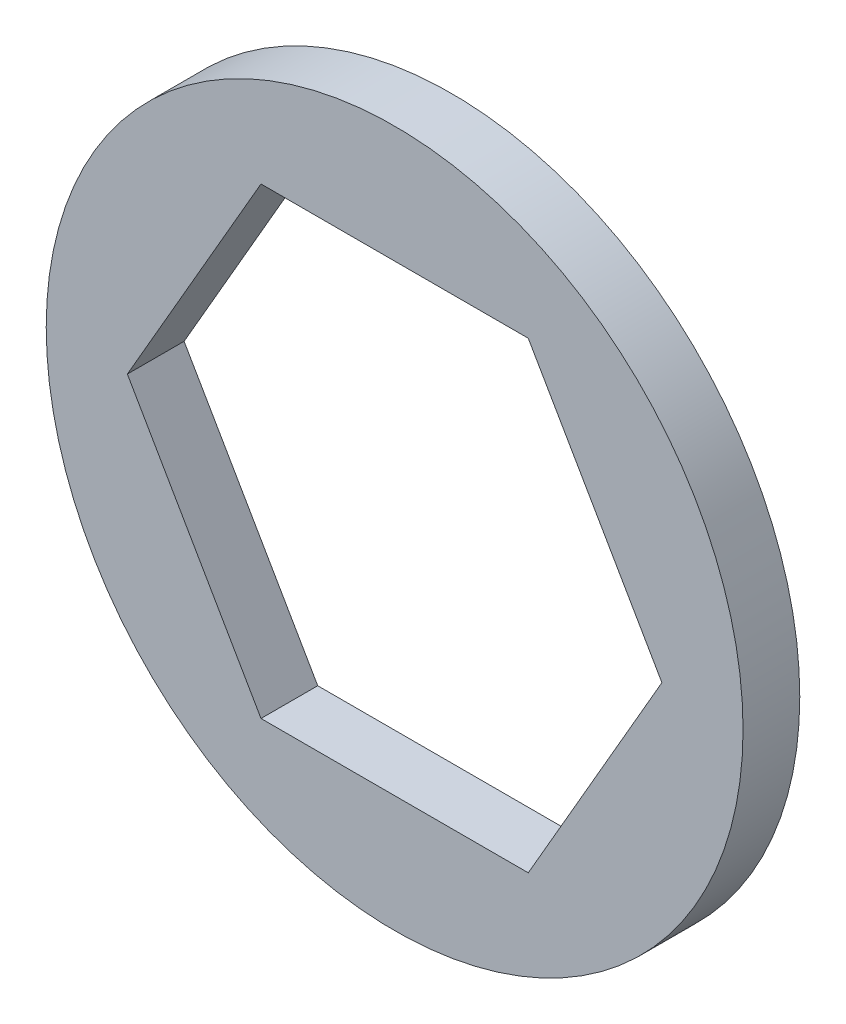
ISO-10303-21;
HEADER;
FILE_DESCRIPTION(('STEP AP214'),'2;1');
FILE_NAME('part.step','',(''),(''),'','','');
FILE_SCHEMA(('AUTOMOTIVE_DESIGN { 1 0 10303 214 1 1 1 1 }'));
ENDSEC;
DATA;
#1=APPLICATION_CONTEXT('core data for automotive mechanical design processes');
#2=APPLICATION_PROTOCOL_DEFINITION('international standard','automotive_design',2000,#1);
#3=PRODUCT_CONTEXT('',#1,'mechanical');
#4=PRODUCT('Part','Part','',(#3));
#5=PRODUCT_RELATED_PRODUCT_CATEGORY('part','',(#4));
#6=PRODUCT_DEFINITION_FORMATION('','',#4);
#7=PRODUCT_DEFINITION_CONTEXT('part definition',#1,'design');
#8=PRODUCT_DEFINITION('design','',#6,#7);
#9=PRODUCT_DEFINITION_SHAPE('','',#8);
#10=(LENGTH_UNIT() NAMED_UNIT(*) SI_UNIT(.MILLI.,.METRE.));
#11=(NAMED_UNIT(*) PLANE_ANGLE_UNIT() SI_UNIT($,.RADIAN.));
#12=(NAMED_UNIT(*) SI_UNIT($,.STERADIAN.) SOLID_ANGLE_UNIT());
#13=UNCERTAINTY_MEASURE_WITH_UNIT(LENGTH_MEASURE(1.E-05),#10,'distance_accuracy_value','');
#14=(GEOMETRIC_REPRESENTATION_CONTEXT(3) GLOBAL_UNCERTAINTY_ASSIGNED_CONTEXT((#13)) GLOBAL_UNIT_ASSIGNED_CONTEXT((#10,
#11,#12)) REPRESENTATION_CONTEXT('',''));
#15=CARTESIAN_POINT('',(0.,0.,0.));
#16=DIRECTION('',(0.,0.,1.));
#17=DIRECTION('',(1.,0.,0.));
#18=AXIS2_PLACEMENT_3D('',#15,#16,#17);
#19=CARTESIAN_POINT('',(0.,0.,0.79375));
#20=DIRECTION('',(0.,0.,1.));
#21=DIRECTION('',(1.,0.,0.));
#22=AXIS2_PLACEMENT_3D('',#19,#20,#21);
#23=PLANE('',#22);
#24=DIRECTION('',(1.,0.,0.));
#25=VECTOR('',#24,1.);
#26=CARTESIAN_POINT('',(3.7394976935412,6.477,0.79375));
#27=LINE('',#26,#25);
#28=CARTESIAN_POINT('',(3.7394976935412,6.477,0.79375));
#29=VERTEX_POINT('',#28);
#30=CARTESIAN_POINT('',(-3.73949769354121,6.477,0.79375));
#31=VERTEX_POINT('',#30);
#32=EDGE_CURVE('E67',#29,#31,#27,.F.);
#33=ORIENTED_EDGE('',*,*,#32,.F.);
#34=DIRECTION('',(0.5,-0.866025403784439,0.));
#35=VECTOR('',#34,1.);
#36=CARTESIAN_POINT('',(7.47899538708241,0.,0.79375));
#37=LINE('',#36,#35);
#38=CARTESIAN_POINT('',(7.47899538708242,0.,0.79375));
#39=VERTEX_POINT('',#38);
#40=EDGE_CURVE('E115',#39,#29,#37,.F.);
#41=ORIENTED_EDGE('',*,*,#40,.F.);
#42=DIRECTION('',(-0.5,-0.866025403784439,0.));
#43=VECTOR('',#42,1.);
#44=CARTESIAN_POINT('',(3.73949769354121,-6.477,0.79375));
#45=LINE('',#44,#43);
#46=CARTESIAN_POINT('',(3.73949769354121,-6.477,0.79375));
#47=VERTEX_POINT('',#46);
#48=EDGE_CURVE('E111',#47,#39,#45,.F.);
#49=ORIENTED_EDGE('',*,*,#48,.F.);
#50=DIRECTION('',(1.,0.,0.));
#51=VECTOR('',#50,1.);
#52=CARTESIAN_POINT('',(-3.73949769354121,-6.477,0.79375));
#53=LINE('',#52,#51);
#54=CARTESIAN_POINT('',(-3.73949769354121,-6.477,0.79375));
#55=VERTEX_POINT('',#54);
#56=EDGE_CURVE('E86',#55,#47,#53,.T.);
#57=ORIENTED_EDGE('',*,*,#56,.F.);
#58=DIRECTION('',(-0.5,0.866025403784439,0.));
#59=VECTOR('',#58,1.);
#60=CARTESIAN_POINT('',(-7.47899538708241,0.,0.79375));
#61=LINE('',#60,#59);
#62=CARTESIAN_POINT('',(-7.47899538708241,0.,0.79375));
#63=VERTEX_POINT('',#62);
#64=EDGE_CURVE('E81',#63,#55,#61,.F.);
#65=ORIENTED_EDGE('',*,*,#64,.F.);
#66=DIRECTION('',(0.5,0.866025403784439,0.));
#67=VECTOR('',#66,1.);
#68=CARTESIAN_POINT('',(-3.73949769354121,6.477,0.79375));
#69=LINE('',#68,#67);
#70=EDGE_CURVE('E72',#31,#63,#69,.F.);
#71=ORIENTED_EDGE('',*,*,#70,.F.);
#72=EDGE_LOOP('',(#33,#41,#49,#57,#65,#71));
#73=FACE_BOUND('',#72,.T.);
#74=CARTESIAN_POINT('',(0.,0.,0.79375));
#75=DIRECTION('',(0.,0.,-1.));
#76=DIRECTION('',(-1.,0.,0.));
#77=AXIS2_PLACEMENT_3D('',#74,#75,#76);
#78=CIRCLE('',#77,9.75);
#79=CARTESIAN_POINT('',(-9.75,0.,0.79375));
#80=VERTEX_POINT('',#79);
#81=EDGE_CURVE('E21',#80,#80,#78,.T.);
#82=ORIENTED_EDGE('',*,*,#81,.F.);
#83=EDGE_LOOP('',(#82));
#84=FACE_BOUND('',#83,.T.);
#85=ADVANCED_FACE('F18',(#73,#84),#23,.T.);
#86=CARTESIAN_POINT('',(0.,0.,0.79375));
#87=DIRECTION('',(0.,0.,-1.));
#88=DIRECTION('',(-1.,0.,0.));
#89=AXIS2_PLACEMENT_3D('',#86,#87,#88);
#90=CYLINDRICAL_SURFACE('',#89,9.75);
#91=ORIENTED_EDGE('',*,*,#81,.T.);
#92=EDGE_LOOP('',(#91));
#93=FACE_BOUND('',#92,.T.);
#94=CARTESIAN_POINT('',(0.,0.,-0.79375));
#95=DIRECTION('',(0.,0.,-1.));
#96=DIRECTION('',(-1.,0.,0.));
#97=AXIS2_PLACEMENT_3D('',#94,#95,#96);
#98=CIRCLE('',#97,9.75);
#99=CARTESIAN_POINT('',(-9.75,0.,-0.79375));
#100=VERTEX_POINT('',#99);
#101=EDGE_CURVE('E97',#100,#100,#98,.F.);
#102=ORIENTED_EDGE('',*,*,#101,.T.);
#103=EDGE_LOOP('',(#102));
#104=FACE_BOUND('',#103,.T.);
#105=ADVANCED_FACE('F182',(#93,#104),#90,.T.);
#106=CARTESIAN_POINT('',(-7.47899538708241,0.,0.79375));
#107=DIRECTION('',(0.866025403784439,0.5,0.));
#108=DIRECTION('',(-0.5,0.866025403784439,0.));
#109=AXIS2_PLACEMENT_3D('',#106,#107,#108);
#110=PLANE('',#109);
#111=ORIENTED_EDGE('',*,*,#64,.T.);
#112=DIRECTION('',(0.,0.,1.));
#113=VECTOR('',#112,1.);
#114=CARTESIAN_POINT('',(-3.73949769354121,-6.477,0.79375));
#115=LINE('',#114,#113);
#116=CARTESIAN_POINT('',(-3.73949769354121,-6.477,-0.79375));
#117=VERTEX_POINT('',#116);
#118=EDGE_CURVE('E104',#117,#55,#115,.T.);
#119=ORIENTED_EDGE('',*,*,#118,.F.);
#120=DIRECTION('',(-0.5,0.866025403784439,0.));
#121=VECTOR('',#120,1.);
#122=CARTESIAN_POINT('',(-3.73949769354121,-6.477,-0.79375));
#123=LINE('',#122,#121);
#124=CARTESIAN_POINT('',(-7.47899538708241,0.,-0.79375));
#125=VERTEX_POINT('',#124);
#126=EDGE_CURVE('E93',#117,#125,#123,.T.);
#127=ORIENTED_EDGE('',*,*,#126,.T.);
#128=DIRECTION('',(0.,0.,1.));
#129=VECTOR('',#128,1.);
#130=CARTESIAN_POINT('',(-7.47899538708241,0.,0.79375));
#131=LINE('',#130,#129);
#132=EDGE_CURVE('E77',#63,#125,#131,.F.);
#133=ORIENTED_EDGE('',*,*,#132,.F.);
#134=EDGE_LOOP('',(#111,#119,#127,#133));
#135=FACE_BOUND('',#134,.T.);
#136=ADVANCED_FACE('F92',(#135),#110,.T.);
#137=CARTESIAN_POINT('',(-3.73949769354121,6.477,0.79375));
#138=DIRECTION('',(0.866025403784439,-0.5,0.));
#139=DIRECTION('',(0.5,0.866025403784439,0.));
#140=AXIS2_PLACEMENT_3D('',#137,#138,#139);
#141=PLANE('',#140);
#142=ORIENTED_EDGE('',*,*,#70,.T.);
#143=ORIENTED_EDGE('',*,*,#132,.T.);
#144=DIRECTION('',(0.5,0.866025403784439,0.));
#145=VECTOR('',#144,1.);
#146=CARTESIAN_POINT('',(-7.47899538708241,0.,-0.79375));
#147=LINE('',#146,#145);
#148=CARTESIAN_POINT('',(-3.73949769354121,6.477,-0.79375));
#149=VERTEX_POINT('',#148);
#150=EDGE_CURVE('E101',#125,#149,#147,.T.);
#151=ORIENTED_EDGE('',*,*,#150,.T.);
#152=DIRECTION('',(0.,0.,1.));
#153=VECTOR('',#152,1.);
#154=CARTESIAN_POINT('',(-3.73949769354121,6.477,0.79375));
#155=LINE('',#154,#153);
#156=EDGE_CURVE('E79',#31,#149,#155,.F.);
#157=ORIENTED_EDGE('',*,*,#156,.F.);
#158=EDGE_LOOP('',(#142,#143,#151,#157));
#159=FACE_BOUND('',#158,.T.);
#160=ADVANCED_FACE('F74',(#159),#141,.T.);
#161=CARTESIAN_POINT('',(3.7394976935412,6.477,0.79375));
#162=DIRECTION('',(0.,-1.,0.));
#163=DIRECTION('',(1.,0.,0.));
#164=AXIS2_PLACEMENT_3D('',#161,#162,#163);
#165=PLANE('',#164);
#166=ORIENTED_EDGE('',*,*,#32,.T.);
#167=ORIENTED_EDGE('',*,*,#156,.T.);
#168=DIRECTION('',(1.,0.,0.));
#169=VECTOR('',#168,1.);
#170=CARTESIAN_POINT('',(0.,6.477,-0.79375));
#171=LINE('',#170,#169);
#172=CARTESIAN_POINT('',(3.7394976935412,6.477,-0.79375));
#173=VERTEX_POINT('',#172);
#174=EDGE_CURVE('E119',#149,#173,#171,.T.);
#175=ORIENTED_EDGE('',*,*,#174,.T.);
#176=DIRECTION('',(0.,0.,1.));
#177=VECTOR('',#176,1.);
#178=CARTESIAN_POINT('',(3.7394976935412,6.47700000000001,0.79375));
#179=LINE('',#178,#177);
#180=EDGE_CURVE('E113',#29,#173,#179,.F.);
#181=ORIENTED_EDGE('',*,*,#180,.F.);
#182=EDGE_LOOP('',(#166,#167,#175,#181));
#183=FACE_BOUND('',#182,.T.);
#184=ADVANCED_FACE('F118',(#183),#165,.T.);
#185=CARTESIAN_POINT('',(7.47899538708241,0.,0.79375));
#186=DIRECTION('',(-0.866025403784439,-0.5,0.));
#187=DIRECTION('',(0.5,-0.866025403784439,0.));
#188=AXIS2_PLACEMENT_3D('',#185,#186,#187);
#189=PLANE('',#188);
#190=ORIENTED_EDGE('',*,*,#40,.T.);
#191=ORIENTED_EDGE('',*,*,#180,.T.);
#192=DIRECTION('',(0.5,-0.866025403784438,0.));
#193=VECTOR('',#192,1.);
#194=CARTESIAN_POINT('',(3.7394976935412,6.477,-0.79375));
#195=LINE('',#194,#193);
#196=CARTESIAN_POINT('',(7.47899538708241,0.,-0.79375));
#197=VERTEX_POINT('',#196);
#198=EDGE_CURVE('E126',#173,#197,#195,.T.);
#199=ORIENTED_EDGE('',*,*,#198,.T.);
#200=DIRECTION('',(0.,0.,1.));
#201=VECTOR('',#200,1.);
#202=CARTESIAN_POINT('',(7.47899538708242,0.,0.79375));
#203=LINE('',#202,#201);
#204=EDGE_CURVE('E109',#39,#197,#203,.F.);
#205=ORIENTED_EDGE('',*,*,#204,.F.);
#206=EDGE_LOOP('',(#190,#191,#199,#205));
#207=FACE_BOUND('',#206,.T.);
#208=ADVANCED_FACE('F135',(#207),#189,.T.);
#209=CARTESIAN_POINT('',(3.73949769354121,-6.477,0.79375));
#210=DIRECTION('',(-0.866025403784439,0.5,0.));
#211=DIRECTION('',(-0.5,-0.866025403784439,0.));
#212=AXIS2_PLACEMENT_3D('',#209,#210,#211);
#213=PLANE('',#212);
#214=ORIENTED_EDGE('',*,*,#48,.T.);
#215=ORIENTED_EDGE('',*,*,#204,.T.);
#216=DIRECTION('',(-0.5,-0.866025403784439,0.));
#217=VECTOR('',#216,1.);
#218=CARTESIAN_POINT('',(7.47899538708241,0.,-0.79375));
#219=LINE('',#218,#217);
#220=CARTESIAN_POINT('',(3.73949769354121,-6.477,-0.79375));
#221=VERTEX_POINT('',#220);
#222=EDGE_CURVE('E27',#197,#221,#219,.T.);
#223=ORIENTED_EDGE('',*,*,#222,.T.);
#224=DIRECTION('',(0.,0.,1.));
#225=VECTOR('',#224,1.);
#226=CARTESIAN_POINT('',(3.73949769354121,-6.477,0.79375));
#227=LINE('',#226,#225);
#228=EDGE_CURVE('E35',#47,#221,#227,.F.);
#229=ORIENTED_EDGE('',*,*,#228,.F.);
#230=EDGE_LOOP('',(#214,#215,#223,#229));
#231=FACE_BOUND('',#230,.T.);
#232=ADVANCED_FACE('F132',(#231),#213,.T.);
#233=CARTESIAN_POINT('',(-3.73949769354121,-6.477,0.79375));
#234=DIRECTION('',(0.,1.,0.));
#235=DIRECTION('',(0.,0.,1.));
#236=AXIS2_PLACEMENT_3D('',#233,#234,#235);
#237=PLANE('',#236);
#238=ORIENTED_EDGE('',*,*,#56,.T.);
#239=ORIENTED_EDGE('',*,*,#228,.T.);
#240=DIRECTION('',(1.,0.,0.));
#241=VECTOR('',#240,1.);
#242=CARTESIAN_POINT('',(0.,-6.477,-0.79375));
#243=LINE('',#242,#241);
#244=EDGE_CURVE('E11',#221,#117,#243,.F.);
#245=ORIENTED_EDGE('',*,*,#244,.T.);
#246=ORIENTED_EDGE('',*,*,#118,.T.);
#247=EDGE_LOOP('',(#238,#239,#245,#246));
#248=FACE_BOUND('',#247,.T.);
#249=ADVANCED_FACE('F144',(#248),#237,.T.);
#250=CARTESIAN_POINT('',(0.,0.,-0.79375));
#251=DIRECTION('',(0.,0.,1.));
#252=DIRECTION('',(1.,0.,0.));
#253=AXIS2_PLACEMENT_3D('',#250,#251,#252);
#254=PLANE('',#253);
#255=ORIENTED_EDGE('',*,*,#222,.F.);
#256=ORIENTED_EDGE('',*,*,#198,.F.);
#257=ORIENTED_EDGE('',*,*,#174,.F.);
#258=ORIENTED_EDGE('',*,*,#150,.F.);
#259=ORIENTED_EDGE('',*,*,#126,.F.);
#260=ORIENTED_EDGE('',*,*,#244,.F.);
#261=EDGE_LOOP('',(#255,#256,#257,#258,#259,#260));
#262=FACE_BOUND('',#261,.T.);
#263=ORIENTED_EDGE('',*,*,#101,.F.);
#264=EDGE_LOOP('',(#263));
#265=FACE_BOUND('',#264,.T.);
#266=ADVANCED_FACE('F123',(#262,#265),#254,.F.);
#267=CLOSED_SHELL('',(#85,#105,#136,#160,#184,#208,#232,#249,#266));
#268=MANIFOLD_SOLID_BREP('B1',#267);
#269=ADVANCED_BREP_SHAPE_REPRESENTATION('',(#18,#268),#14);
#270=SHAPE_DEFINITION_REPRESENTATION(#9,#269);
ENDSEC;
END-ISO-10303-21;
